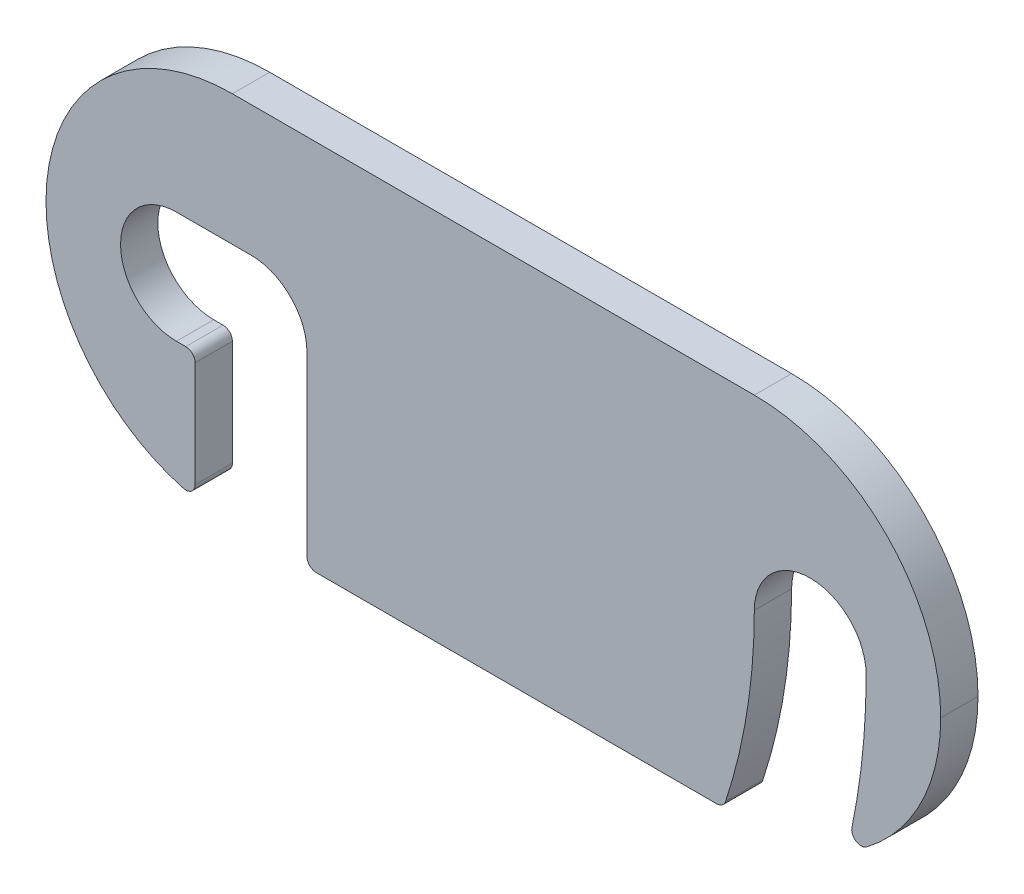
ISO-10303-21;
HEADER;
FILE_DESCRIPTION(('STEP AP214'),'2;1');
FILE_NAME('part.step','',(''),(''),'','','');
FILE_SCHEMA(('AUTOMOTIVE_DESIGN { 1 0 10303 214 1 1 1 1 }'));
ENDSEC;
DATA;
#1=APPLICATION_CONTEXT('core data for automotive mechanical design processes');
#2=APPLICATION_PROTOCOL_DEFINITION('international standard','automotive_design',2000,#1);
#3=PRODUCT_CONTEXT('',#1,'mechanical');
#4=PRODUCT('Part','Part','',(#3));
#5=PRODUCT_RELATED_PRODUCT_CATEGORY('part','',(#4));
#6=PRODUCT_DEFINITION_FORMATION('','',#4);
#7=PRODUCT_DEFINITION_CONTEXT('part definition',#1,'design');
#8=PRODUCT_DEFINITION('design','',#6,#7);
#9=PRODUCT_DEFINITION_SHAPE('','',#8);
#10=(LENGTH_UNIT() NAMED_UNIT(*) SI_UNIT(.MILLI.,.METRE.));
#11=(NAMED_UNIT(*) PLANE_ANGLE_UNIT() SI_UNIT($,.RADIAN.));
#12=(NAMED_UNIT(*) SI_UNIT($,.STERADIAN.) SOLID_ANGLE_UNIT());
#13=UNCERTAINTY_MEASURE_WITH_UNIT(LENGTH_MEASURE(1.E-05),#10,'distance_accuracy_value','');
#14=(GEOMETRIC_REPRESENTATION_CONTEXT(3) GLOBAL_UNCERTAINTY_ASSIGNED_CONTEXT((#13)) GLOBAL_UNIT_ASSIGNED_CONTEXT((#10,
#11,#12)) REPRESENTATION_CONTEXT('',''));
#15=CARTESIAN_POINT('',(0.,0.,0.));
#16=DIRECTION('',(0.,0.,1.));
#17=DIRECTION('',(1.,0.,0.));
#18=AXIS2_PLACEMENT_3D('',#15,#16,#17);
#19=CARTESIAN_POINT('',(0.,0.,2.));
#20=DIRECTION('',(0.,-1.,0.));
#21=DIRECTION('',(1.,0.,0.));
#22=AXIS2_PLACEMENT_3D('',#19,#20,#21);
#23=PLANE('',#22);
#24=DIRECTION('',(-1.,0.,0.));
#25=VECTOR('',#24,1.);
#26=CARTESIAN_POINT('',(0.,0.,2.));
#27=LINE('',#26,#25);
#28=CARTESIAN_POINT('',(-10.,0.,2.));
#29=VERTEX_POINT('',#28);
#30=CARTESIAN_POINT('',(-38.,0.,2.));
#31=VERTEX_POINT('',#30);
#32=EDGE_CURVE('E313',#29,#31,#27,.T.);
#33=ORIENTED_EDGE('',*,*,#32,.F.);
#34=DIRECTION('',(0.,0.,-1.));
#35=VECTOR('',#34,1.);
#36=CARTESIAN_POINT('',(-10.,0.,0.));
#37=LINE('',#36,#35);
#38=CARTESIAN_POINT('',(-10.,0.,0.));
#39=VERTEX_POINT('',#38);
#40=EDGE_CURVE('E223',#29,#39,#37,.T.);
#41=ORIENTED_EDGE('',*,*,#40,.T.);
#42=DIRECTION('',(-1.,0.,0.));
#43=VECTOR('',#42,1.);
#44=CARTESIAN_POINT('',(0.,0.,0.));
#45=LINE('',#44,#43);
#46=CARTESIAN_POINT('',(-38.,0.,0.));
#47=VERTEX_POINT('',#46);
#48=EDGE_CURVE('E208',#39,#47,#45,.T.);
#49=ORIENTED_EDGE('',*,*,#48,.T.);
#50=DIRECTION('',(0.,0.,-1.));
#51=VECTOR('',#50,1.);
#52=CARTESIAN_POINT('',(-38.,0.,2.));
#53=LINE('',#52,#51);
#54=EDGE_CURVE('E221',#47,#31,#53,.F.);
#55=ORIENTED_EDGE('',*,*,#54,.T.);
#56=EDGE_LOOP('',(#33,#41,#49,#55));
#57=FACE_BOUND('',#56,.T.);
#58=ADVANCED_FACE('F38',(#57),#23,.F.);
#59=CARTESIAN_POINT('',(0.,-20.,2.));
#60=DIRECTION('',(0.,-1.,0.));
#61=DIRECTION('',(1.,0.,0.));
#62=AXIS2_PLACEMENT_3D('',#59,#60,#61);
#63=PLANE('',#62);
#64=DIRECTION('',(-1.,0.,0.));
#65=VECTOR('',#64,1.);
#66=CARTESIAN_POINT('',(0.,-20.,0.));
#67=LINE('',#66,#65);
#68=CARTESIAN_POINT('',(-12.0172465076211,-20.,0.));
#69=VERTEX_POINT('',#68);
#70=CARTESIAN_POINT('',(-33.5,-20.,0.));
#71=VERTEX_POINT('',#70);
#72=EDGE_CURVE('E219',#69,#71,#67,.T.);
#73=ORIENTED_EDGE('',*,*,#72,.F.);
#74=DIRECTION('',(0.,0.,-1.));
#75=VECTOR('',#74,1.);
#76=CARTESIAN_POINT('',(-12.0172465076211,-20.,2.));
#77=LINE('',#76,#75);
#78=CARTESIAN_POINT('',(-12.0172465076211,-20.,2.));
#79=VERTEX_POINT('',#78);
#80=EDGE_CURVE('E290',#69,#79,#77,.F.);
#81=ORIENTED_EDGE('',*,*,#80,.T.);
#82=DIRECTION('',(-1.,0.,0.));
#83=VECTOR('',#82,1.);
#84=CARTESIAN_POINT('',(0.,-20.,2.));
#85=LINE('',#84,#83);
#86=CARTESIAN_POINT('',(-33.5,-20.,2.));
#87=VERTEX_POINT('',#86);
#88=EDGE_CURVE('E214',#79,#87,#85,.T.);
#89=ORIENTED_EDGE('',*,*,#88,.T.);
#90=DIRECTION('',(0.,0.,1.));
#91=VECTOR('',#90,1.);
#92=CARTESIAN_POINT('',(-33.5,-20.,0.));
#93=LINE('',#92,#91);
#94=EDGE_CURVE('E53',#87,#71,#93,.F.);
#95=ORIENTED_EDGE('',*,*,#94,.T.);
#96=EDGE_LOOP('',(#73,#81,#89,#95));
#97=FACE_BOUND('',#96,.T.);
#98=ADVANCED_FACE('F308',(#97),#63,.T.);
#99=CARTESIAN_POINT('',(-7.,-10.,2.));
#100=DIRECTION('',(0.,0.,-1.));
#101=DIRECTION('',(-1.,0.,0.));
#102=AXIS2_PLACEMENT_3D('',#99,#100,#101);
#103=CYLINDRICAL_SURFACE('',#102,3.);
#104=DIRECTION('',(0.,0.,1.));
#105=VECTOR('',#104,1.);
#106=CARTESIAN_POINT('',(-9.99999999999999,-10.,0.));
#107=LINE('',#106,#105);
#108=CARTESIAN_POINT('',(-9.99999999999999,-10.,0.));
#109=VERTEX_POINT('',#108);
#110=CARTESIAN_POINT('',(-9.99999999999999,-10.,2.));
#111=VERTEX_POINT('',#110);
#112=EDGE_CURVE('E325',#109,#111,#107,.T.);
#113=ORIENTED_EDGE('',*,*,#112,.F.);
#114=CARTESIAN_POINT('',(-7.,-10.,0.));
#115=DIRECTION('',(0.,0.,1.));
#116=DIRECTION('',(1.,0.,0.));
#117=AXIS2_PLACEMENT_3D('',#114,#115,#116);
#118=CIRCLE('',#117,3.);
#119=CARTESIAN_POINT('',(-4.,-10.,0.));
#120=VERTEX_POINT('',#119);
#121=EDGE_CURVE('E204',#120,#109,#118,.T.);
#122=ORIENTED_EDGE('',*,*,#121,.F.);
#123=DIRECTION('',(0.,0.,1.));
#124=VECTOR('',#123,1.);
#125=CARTESIAN_POINT('',(-4.,-10.,0.));
#126=LINE('',#125,#124);
#127=CARTESIAN_POINT('',(-4.,-10.,2.));
#128=VERTEX_POINT('',#127);
#129=EDGE_CURVE('E322',#120,#128,#126,.T.);
#130=ORIENTED_EDGE('',*,*,#129,.T.);
#131=CARTESIAN_POINT('',(-7.,-10.,2.));
#132=DIRECTION('',(0.,0.,1.));
#133=DIRECTION('',(1.,0.,0.));
#134=AXIS2_PLACEMENT_3D('',#131,#132,#133);
#135=CIRCLE('',#134,3.);
#136=EDGE_CURVE('E315',#128,#111,#135,.T.);
#137=ORIENTED_EDGE('',*,*,#136,.T.);
#138=EDGE_LOOP('',(#113,#122,#130,#137));
#139=FACE_BOUND('',#138,.T.);
#140=ADVANCED_FACE('F386',(#139),#103,.F.);
#141=CARTESIAN_POINT('',(-41.,-10.,2.));
#142=DIRECTION('',(0.,0.,-1.));
#143=DIRECTION('',(-1.,0.,0.));
#144=AXIS2_PLACEMENT_3D('',#141,#142,#143);
#145=CYLINDRICAL_SURFACE('',#144,3.00000000000001);
#146=DIRECTION('',(0.,0.,1.));
#147=VECTOR('',#146,1.);
#148=CARTESIAN_POINT('',(-41.,-7.,0.));
#149=LINE('',#148,#147);
#150=CARTESIAN_POINT('',(-41.,-7.,0.));
#151=VERTEX_POINT('',#150);
#152=CARTESIAN_POINT('',(-41.,-7.,2.));
#153=VERTEX_POINT('',#152);
#154=EDGE_CURVE('E197',#151,#153,#149,.T.);
#155=ORIENTED_EDGE('',*,*,#154,.T.);
#156=CARTESIAN_POINT('',(-41.,-10.,2.));
#157=DIRECTION('',(0.,0.,1.));
#158=DIRECTION('',(1.,0.,0.));
#159=AXIS2_PLACEMENT_3D('',#156,#157,#158);
#160=CIRCLE('',#159,3.00000000000001);
#161=CARTESIAN_POINT('',(-41.,-13.,2.));
#162=VERTEX_POINT('',#161);
#163=EDGE_CURVE('E196',#153,#162,#160,.T.);
#164=ORIENTED_EDGE('',*,*,#163,.T.);
#165=DIRECTION('',(0.,0.,1.));
#166=VECTOR('',#165,1.);
#167=CARTESIAN_POINT('',(-41.,-13.,0.));
#168=LINE('',#167,#166);
#169=CARTESIAN_POINT('',(-41.,-13.,0.));
#170=VERTEX_POINT('',#169);
#171=EDGE_CURVE('E180',#170,#162,#168,.T.);
#172=ORIENTED_EDGE('',*,*,#171,.F.);
#173=CARTESIAN_POINT('',(-41.,-10.,0.));
#174=DIRECTION('',(0.,0.,1.));
#175=DIRECTION('',(1.,0.,0.));
#176=AXIS2_PLACEMENT_3D('',#173,#174,#175);
#177=CIRCLE('',#176,3.00000000000001);
#178=EDGE_CURVE('E194',#151,#170,#177,.T.);
#179=ORIENTED_EDGE('',*,*,#178,.F.);
#180=EDGE_LOOP('',(#155,#164,#172,#179));
#181=FACE_BOUND('',#180,.T.);
#182=ADVANCED_FACE('F193',(#181),#145,.F.);
#183=CARTESIAN_POINT('',(0.,0.,2.));
#184=DIRECTION('',(0.,0.,1.));
#185=DIRECTION('',(1.,0.,0.));
#186=AXIS2_PLACEMENT_3D('',#183,#184,#185);
#187=PLANE('',#186);
#188=CARTESIAN_POINT('',(-41.,-10.,2.));
#189=DIRECTION('',(0.,0.,1.));
#190=DIRECTION('',(1.,0.,0.));
#191=AXIS2_PLACEMENT_3D('',#188,#189,#190);
#192=CIRCLE('',#191,37.);
#193=CARTESIAN_POINT('',(-4.76387096774193,-17.4795021731091,2.));
#194=VERTEX_POINT('',#193);
#195=EDGE_CURVE('E303',#194,#128,#192,.T.);
#196=ORIENTED_EDGE('',*,*,#195,.F.);
#197=CARTESIAN_POINT('',(-4.27419354838709,-17.5805765267998,2.));
#198=DIRECTION('',(0.,0.,1.));
#199=DIRECTION('',(1.,0.,0.));
#200=AXIS2_PLACEMENT_3D('',#197,#198,#199);
#201=CIRCLE('',#200,0.5);
#202=CARTESIAN_POINT('',(-3.97283531409168,-17.9795542387366,2.));
#203=VERTEX_POINT('',#202);
#204=EDGE_CURVE('E267',#194,#203,#201,.T.);
#205=ORIENTED_EDGE('',*,*,#204,.T.);
#206=CARTESIAN_POINT('',(-10.,-10.,2.));
#207=DIRECTION('',(0.,0.,1.));
#208=DIRECTION('',(1.,0.,0.));
#209=AXIS2_PLACEMENT_3D('',#206,#207,#208);
#210=CIRCLE('',#209,10.);
#211=CARTESIAN_POINT('',(0.,-10.,2.));
#212=VERTEX_POINT('',#211);
#213=EDGE_CURVE('E239',#203,#212,#210,.T.);
#214=ORIENTED_EDGE('',*,*,#213,.T.);
#215=CARTESIAN_POINT('',(-10.,-10.,2.));
#216=DIRECTION('',(0.,0.,1.));
#217=DIRECTION('',(1.,0.,0.));
#218=AXIS2_PLACEMENT_3D('',#215,#216,#217);
#219=CIRCLE('',#218,10.);
#220=EDGE_CURVE('E241',#212,#29,#219,.T.);
#221=ORIENTED_EDGE('',*,*,#220,.T.);
#222=ORIENTED_EDGE('',*,*,#32,.T.);
#223=CARTESIAN_POINT('',(-38.,-10.,2.));
#224=DIRECTION('',(0.,0.,1.));
#225=DIRECTION('',(1.,0.,0.));
#226=AXIS2_PLACEMENT_3D('',#223,#224,#225);
#227=CIRCLE('',#226,10.);
#228=CARTESIAN_POINT('',(-48.,-10.,2.));
#229=VERTEX_POINT('',#228);
#230=EDGE_CURVE('E234',#31,#229,#227,.T.);
#231=ORIENTED_EDGE('',*,*,#230,.T.);
#232=CARTESIAN_POINT('',(-38.,-10.,2.));
#233=DIRECTION('',(0.,0.,1.));
#234=DIRECTION('',(1.,0.,0.));
#235=AXIS2_PLACEMENT_3D('',#232,#233,#234);
#236=CIRCLE('',#235,10.);
#237=CARTESIAN_POINT('',(-40.6315789473684,-19.6475277788544,2.));
#238=VERTEX_POINT('',#237);
#239=EDGE_CURVE('E236',#229,#238,#236,.T.);
#240=ORIENTED_EDGE('',*,*,#239,.T.);
#241=CARTESIAN_POINT('',(-40.5,-19.1651513899117,2.));
#242=DIRECTION('',(0.,0.,1.));
#243=DIRECTION('',(1.,0.,0.));
#244=AXIS2_PLACEMENT_3D('',#241,#242,#243);
#245=CIRCLE('',#244,0.5);
#246=CARTESIAN_POINT('',(-40.,-19.1651513899117,2.));
#247=VERTEX_POINT('',#246);
#248=EDGE_CURVE('E263',#238,#247,#245,.T.);
#249=ORIENTED_EDGE('',*,*,#248,.T.);
#250=DIRECTION('',(0.,-1.,0.));
#251=VECTOR('',#250,1.);
#252=CARTESIAN_POINT('',(-40.,-13.,2.));
#253=LINE('',#252,#251);
#254=CARTESIAN_POINT('',(-40.,-13.5,2.));
#255=VERTEX_POINT('',#254);
#256=EDGE_CURVE('E335',#255,#247,#253,.T.);
#257=ORIENTED_EDGE('',*,*,#256,.F.);
#258=CARTESIAN_POINT('',(-40.5,-13.5,2.));
#259=DIRECTION('',(0.,0.,1.));
#260=DIRECTION('',(1.,0.,0.));
#261=AXIS2_PLACEMENT_3D('',#258,#259,#260);
#262=CIRCLE('',#261,0.5);
#263=CARTESIAN_POINT('',(-40.5,-13.,2.));
#264=VERTEX_POINT('',#263);
#265=EDGE_CURVE('E265',#255,#264,#262,.T.);
#266=ORIENTED_EDGE('',*,*,#265,.T.);
#267=DIRECTION('',(1.,0.,0.));
#268=VECTOR('',#267,1.);
#269=CARTESIAN_POINT('',(-41.,-13.,2.));
#270=LINE('',#269,#268);
#271=EDGE_CURVE('E327',#162,#264,#270,.T.);
#272=ORIENTED_EDGE('',*,*,#271,.F.);
#273=ORIENTED_EDGE('',*,*,#163,.F.);
#274=DIRECTION('',(-1.,0.,0.));
#275=VECTOR('',#274,1.);
#276=CARTESIAN_POINT('',(-34.,-7.,2.));
#277=LINE('',#276,#275);
#278=CARTESIAN_POINT('',(-37.,-7.,2.));
#279=VERTEX_POINT('',#278);
#280=EDGE_CURVE('E187',#279,#153,#277,.T.);
#281=ORIENTED_EDGE('',*,*,#280,.F.);
#282=CARTESIAN_POINT('',(-37.,-10.,2.));
#283=DIRECTION('',(0.,0.,1.));
#284=DIRECTION('',(1.,0.,0.));
#285=AXIS2_PLACEMENT_3D('',#282,#283,#284);
#286=CIRCLE('',#285,3.);
#287=CARTESIAN_POINT('',(-34.,-10.,2.));
#288=VERTEX_POINT('',#287);
#289=EDGE_CURVE('E251',#279,#288,#286,.F.);
#290=ORIENTED_EDGE('',*,*,#289,.T.);
#291=DIRECTION('',(0.,1.,0.));
#292=VECTOR('',#291,1.);
#293=CARTESIAN_POINT('',(-34.,-17.5,2.));
#294=LINE('',#293,#292);
#295=CARTESIAN_POINT('',(-34.,-19.5,2.));
#296=VERTEX_POINT('',#295);
#297=EDGE_CURVE('E333',#296,#288,#294,.T.);
#298=ORIENTED_EDGE('',*,*,#297,.F.);
#299=CARTESIAN_POINT('',(-33.5,-19.5,2.));
#300=DIRECTION('',(0.,0.,1.));
#301=DIRECTION('',(1.,0.,0.));
#302=AXIS2_PLACEMENT_3D('',#299,#300,#301);
#303=CIRCLE('',#302,0.5);
#304=EDGE_CURVE('E259',#296,#87,#303,.T.);
#305=ORIENTED_EDGE('',*,*,#304,.T.);
#306=ORIENTED_EDGE('',*,*,#88,.F.);
#307=CARTESIAN_POINT('',(-12.0172465076211,-19.5,2.));
#308=DIRECTION('',(0.,0.,1.));
#309=DIRECTION('',(1.,0.,0.));
#310=AXIS2_PLACEMENT_3D('',#307,#308,#309);
#311=CIRCLE('',#310,0.5);
#312=CARTESIAN_POINT('',(-11.5421194011887,-19.655737704918,2.));
#313=VERTEX_POINT('',#312);
#314=EDGE_CURVE('E261',#79,#313,#311,.T.);
#315=ORIENTED_EDGE('',*,*,#314,.T.);
#316=CARTESIAN_POINT('',(-41.,-10.,2.));
#317=DIRECTION('',(0.,0.,-1.));
#318=DIRECTION('',(1.,0.,0.));
#319=AXIS2_PLACEMENT_3D('',#316,#317,#318);
#320=CIRCLE('',#319,31.);
#321=EDGE_CURVE('E299',#111,#313,#320,.T.);
#322=ORIENTED_EDGE('',*,*,#321,.F.);
#323=ORIENTED_EDGE('',*,*,#136,.F.);
#324=EDGE_LOOP('',(#196,#205,#214,#221,#222,#231,#240,#249,#257,#266,#272,#273,#281,#290,#298,
#305,#306,#315,#322,#323));
#325=FACE_BOUND('',#324,.T.);
#326=ADVANCED_FACE('F311',(#325),#187,.T.);
#327=CARTESIAN_POINT('',(0.,0.,0.));
#328=DIRECTION('',(0.,0.,1.));
#329=DIRECTION('',(1.,0.,0.));
#330=AXIS2_PLACEMENT_3D('',#327,#328,#329);
#331=PLANE('',#330);
#332=CARTESIAN_POINT('',(-10.,-10.,0.));
#333=DIRECTION('',(0.,0.,1.));
#334=DIRECTION('',(1.,0.,0.));
#335=AXIS2_PLACEMENT_3D('',#332,#333,#334);
#336=CIRCLE('',#335,10.);
#337=CARTESIAN_POINT('',(0.,-10.,0.));
#338=VERTEX_POINT('',#337);
#339=CARTESIAN_POINT('',(-3.97283531409168,-17.9795542387366,0.));
#340=VERTEX_POINT('',#339);
#341=EDGE_CURVE('E230',#338,#340,#336,.F.);
#342=ORIENTED_EDGE('',*,*,#341,.T.);
#343=CARTESIAN_POINT('',(-4.27419354838709,-17.5805765267998,0.));
#344=DIRECTION('',(0.,0.,1.));
#345=DIRECTION('',(1.,0.,0.));
#346=AXIS2_PLACEMENT_3D('',#343,#344,#345);
#347=CIRCLE('',#346,0.5);
#348=CARTESIAN_POINT('',(-4.76387096774193,-17.4795021731091,0.));
#349=VERTEX_POINT('',#348);
#350=EDGE_CURVE('E278',#340,#349,#347,.F.);
#351=ORIENTED_EDGE('',*,*,#350,.T.);
#352=CARTESIAN_POINT('',(-41.,-10.,0.));
#353=DIRECTION('',(0.,0.,1.));
#354=DIRECTION('',(1.,0.,0.));
#355=AXIS2_PLACEMENT_3D('',#352,#353,#354);
#356=CIRCLE('',#355,37.);
#357=EDGE_CURVE('E302',#349,#120,#356,.T.);
#358=ORIENTED_EDGE('',*,*,#357,.T.);
#359=ORIENTED_EDGE('',*,*,#121,.T.);
#360=CARTESIAN_POINT('',(-41.,-10.,0.));
#361=DIRECTION('',(0.,0.,-1.));
#362=DIRECTION('',(1.,0.,0.));
#363=AXIS2_PLACEMENT_3D('',#360,#361,#362);
#364=CIRCLE('',#363,31.);
#365=CARTESIAN_POINT('',(-11.5421194011887,-19.655737704918,0.));
#366=VERTEX_POINT('',#365);
#367=EDGE_CURVE('E296',#109,#366,#364,.T.);
#368=ORIENTED_EDGE('',*,*,#367,.T.);
#369=CARTESIAN_POINT('',(-12.0172465076211,-19.5,0.));
#370=DIRECTION('',(0.,0.,1.));
#371=DIRECTION('',(1.,0.,0.));
#372=AXIS2_PLACEMENT_3D('',#369,#370,#371);
#373=CIRCLE('',#372,0.5);
#374=EDGE_CURVE('E60',#366,#69,#373,.F.);
#375=ORIENTED_EDGE('',*,*,#374,.T.);
#376=ORIENTED_EDGE('',*,*,#72,.T.);
#377=CARTESIAN_POINT('',(-33.5,-19.5,0.));
#378=DIRECTION('',(0.,0.,1.));
#379=DIRECTION('',(1.,0.,0.));
#380=AXIS2_PLACEMENT_3D('',#377,#378,#379);
#381=CIRCLE('',#380,0.5);
#382=CARTESIAN_POINT('',(-34.,-19.5,0.));
#383=VERTEX_POINT('',#382);
#384=EDGE_CURVE('E271',#71,#383,#381,.F.);
#385=ORIENTED_EDGE('',*,*,#384,.T.);
#386=DIRECTION('',(0.,1.,0.));
#387=VECTOR('',#386,1.);
#388=CARTESIAN_POINT('',(-34.,-17.5,0.));
#389=LINE('',#388,#387);
#390=CARTESIAN_POINT('',(-34.,-10.,0.));
#391=VERTEX_POINT('',#390);
#392=EDGE_CURVE('E340',#383,#391,#389,.T.);
#393=ORIENTED_EDGE('',*,*,#392,.T.);
#394=CARTESIAN_POINT('',(-37.,-10.,0.));
#395=DIRECTION('',(0.,0.,1.));
#396=DIRECTION('',(1.,0.,0.));
#397=AXIS2_PLACEMENT_3D('',#394,#395,#396);
#398=CIRCLE('',#397,3.);
#399=CARTESIAN_POINT('',(-37.,-7.,0.));
#400=VERTEX_POINT('',#399);
#401=EDGE_CURVE('E254',#391,#400,#398,.T.);
#402=ORIENTED_EDGE('',*,*,#401,.T.);
#403=DIRECTION('',(-1.,0.,0.));
#404=VECTOR('',#403,1.);
#405=CARTESIAN_POINT('',(-34.,-7.,0.));
#406=LINE('',#405,#404);
#407=EDGE_CURVE('E198',#400,#151,#406,.T.);
#408=ORIENTED_EDGE('',*,*,#407,.T.);
#409=ORIENTED_EDGE('',*,*,#178,.T.);
#410=DIRECTION('',(1.,0.,0.));
#411=VECTOR('',#410,1.);
#412=CARTESIAN_POINT('',(-41.,-13.,0.));
#413=LINE('',#412,#411);
#414=CARTESIAN_POINT('',(-40.5,-13.,0.));
#415=VERTEX_POINT('',#414);
#416=EDGE_CURVE('E176',#170,#415,#413,.T.);
#417=ORIENTED_EDGE('',*,*,#416,.T.);
#418=CARTESIAN_POINT('',(-40.5,-13.5,0.));
#419=DIRECTION('',(0.,0.,1.));
#420=DIRECTION('',(1.,0.,0.));
#421=AXIS2_PLACEMENT_3D('',#418,#419,#420);
#422=CIRCLE('',#421,0.5);
#423=CARTESIAN_POINT('',(-40.,-13.5,0.));
#424=VERTEX_POINT('',#423);
#425=EDGE_CURVE('E276',#415,#424,#422,.F.);
#426=ORIENTED_EDGE('',*,*,#425,.T.);
#427=DIRECTION('',(0.,-1.,0.));
#428=VECTOR('',#427,1.);
#429=CARTESIAN_POINT('',(-40.,-13.,0.));
#430=LINE('',#429,#428);
#431=CARTESIAN_POINT('',(-40.,-19.1651513899117,0.));
#432=VERTEX_POINT('',#431);
#433=EDGE_CURVE('E186',#424,#432,#430,.T.);
#434=ORIENTED_EDGE('',*,*,#433,.T.);
#435=CARTESIAN_POINT('',(-40.5,-19.1651513899117,0.));
#436=DIRECTION('',(0.,0.,1.));
#437=DIRECTION('',(1.,0.,0.));
#438=AXIS2_PLACEMENT_3D('',#435,#436,#437);
#439=CIRCLE('',#438,0.5);
#440=CARTESIAN_POINT('',(-40.6315789473684,-19.6475277788544,0.));
#441=VERTEX_POINT('',#440);
#442=EDGE_CURVE('E274',#432,#441,#439,.F.);
#443=ORIENTED_EDGE('',*,*,#442,.T.);
#444=CARTESIAN_POINT('',(-38.,-10.,0.));
#445=DIRECTION('',(0.,0.,1.));
#446=DIRECTION('',(1.,0.,0.));
#447=AXIS2_PLACEMENT_3D('',#444,#445,#446);
#448=CIRCLE('',#447,10.);
#449=CARTESIAN_POINT('',(-48.,-10.,0.));
#450=VERTEX_POINT('',#449);
#451=EDGE_CURVE('E228',#441,#450,#448,.F.);
#452=ORIENTED_EDGE('',*,*,#451,.T.);
#453=CARTESIAN_POINT('',(-38.,-10.,0.));
#454=DIRECTION('',(0.,0.,1.));
#455=DIRECTION('',(1.,0.,0.));
#456=AXIS2_PLACEMENT_3D('',#453,#454,#455);
#457=CIRCLE('',#456,10.);
#458=EDGE_CURVE('E226',#450,#47,#457,.F.);
#459=ORIENTED_EDGE('',*,*,#458,.T.);
#460=ORIENTED_EDGE('',*,*,#48,.F.);
#461=CARTESIAN_POINT('',(-10.,-10.,0.));
#462=DIRECTION('',(0.,0.,1.));
#463=DIRECTION('',(1.,0.,0.));
#464=AXIS2_PLACEMENT_3D('',#461,#462,#463);
#465=CIRCLE('',#464,10.);
#466=EDGE_CURVE('E232',#39,#338,#465,.F.);
#467=ORIENTED_EDGE('',*,*,#466,.T.);
#468=EDGE_LOOP('',(#342,#351,#358,#359,#368,#375,#376,#385,#393,#402,#408,#409,#417,#426,#434,
#443,#452,#459,#460,#467));
#469=FACE_BOUND('',#468,.T.);
#470=ADVANCED_FACE('F201',(#469),#331,.F.);
#471=CARTESIAN_POINT('',(-10.,-10.,2.));
#472=DIRECTION('',(0.,0.,-1.));
#473=DIRECTION('',(-1.,0.,0.));
#474=AXIS2_PLACEMENT_3D('',#471,#472,#473);
#475=CYLINDRICAL_SURFACE('',#474,10.);
#476=ORIENTED_EDGE('',*,*,#213,.F.);
#477=DIRECTION('',(0.,0.,-1.));
#478=VECTOR('',#477,1.);
#479=CARTESIAN_POINT('',(-3.97283531409168,-17.9795542387366,2.));
#480=LINE('',#479,#478);
#481=EDGE_CURVE('E269',#203,#340,#480,.T.);
#482=ORIENTED_EDGE('',*,*,#481,.T.);
#483=ORIENTED_EDGE('',*,*,#341,.F.);
#484=DIRECTION('',(0.,0.,-1.));
#485=VECTOR('',#484,1.);
#486=CARTESIAN_POINT('',(0.,-10.,2.));
#487=LINE('',#486,#485);
#488=EDGE_CURVE('E205',#212,#338,#487,.T.);
#489=ORIENTED_EDGE('',*,*,#488,.F.);
#490=EDGE_LOOP('',(#476,#482,#483,#489));
#491=FACE_BOUND('',#490,.T.);
#492=ADVANCED_FACE('F375',(#491),#475,.T.);
#493=CARTESIAN_POINT('',(-10.,-10.,2.));
#494=DIRECTION('',(0.,0.,1.));
#495=DIRECTION('',(1.,0.,0.));
#496=AXIS2_PLACEMENT_3D('',#493,#494,#495);
#497=CYLINDRICAL_SURFACE('',#496,10.);
#498=ORIENTED_EDGE('',*,*,#220,.F.);
#499=ORIENTED_EDGE('',*,*,#488,.T.);
#500=ORIENTED_EDGE('',*,*,#466,.F.);
#501=ORIENTED_EDGE('',*,*,#40,.F.);
#502=EDGE_LOOP('',(#498,#499,#500,#501));
#503=FACE_BOUND('',#502,.T.);
#504=ADVANCED_FACE('F369',(#503),#497,.T.);
#505=CARTESIAN_POINT('',(-38.,-10.,2.));
#506=DIRECTION('',(0.,0.,-1.));
#507=DIRECTION('',(-1.,0.,0.));
#508=AXIS2_PLACEMENT_3D('',#505,#506,#507);
#509=CYLINDRICAL_SURFACE('',#508,10.);
#510=DIRECTION('',(0.,0.,-1.));
#511=VECTOR('',#510,1.);
#512=CARTESIAN_POINT('',(-48.,-10.,2.));
#513=LINE('',#512,#511);
#514=EDGE_CURVE('E211',#229,#450,#513,.T.);
#515=ORIENTED_EDGE('',*,*,#514,.F.);
#516=ORIENTED_EDGE('',*,*,#230,.F.);
#517=ORIENTED_EDGE('',*,*,#54,.F.);
#518=ORIENTED_EDGE('',*,*,#458,.F.);
#519=EDGE_LOOP('',(#515,#516,#517,#518));
#520=FACE_BOUND('',#519,.T.);
#521=ADVANCED_FACE('F363',(#520),#509,.T.);
#522=CARTESIAN_POINT('',(-38.,-10.,2.));
#523=DIRECTION('',(0.,0.,1.));
#524=DIRECTION('',(1.,0.,0.));
#525=AXIS2_PLACEMENT_3D('',#522,#523,#524);
#526=CYLINDRICAL_SURFACE('',#525,10.);
#527=ORIENTED_EDGE('',*,*,#451,.F.);
#528=DIRECTION('',(0.,0.,1.));
#529=VECTOR('',#528,1.);
#530=CARTESIAN_POINT('',(-40.6315789473684,-19.6475277788544,2.));
#531=LINE('',#530,#529);
#532=EDGE_CURVE('E287',#441,#238,#531,.T.);
#533=ORIENTED_EDGE('',*,*,#532,.T.);
#534=ORIENTED_EDGE('',*,*,#239,.F.);
#535=ORIENTED_EDGE('',*,*,#514,.T.);
#536=EDGE_LOOP('',(#527,#533,#534,#535));
#537=FACE_BOUND('',#536,.T.);
#538=ADVANCED_FACE('F358',(#537),#526,.T.);
#539=CARTESIAN_POINT('',(-40.,-13.,0.));
#540=DIRECTION('',(-1.,0.,0.));
#541=DIRECTION('',(0.,0.,1.));
#542=AXIS2_PLACEMENT_3D('',#539,#540,#541);
#543=PLANE('',#542);
#544=ORIENTED_EDGE('',*,*,#433,.F.);
#545=DIRECTION('',(0.,0.,1.));
#546=VECTOR('',#545,1.);
#547=CARTESIAN_POINT('',(-40.,-13.5,0.));
#548=LINE('',#547,#546);
#549=EDGE_CURVE('E283',#424,#255,#548,.T.);
#550=ORIENTED_EDGE('',*,*,#549,.T.);
#551=ORIENTED_EDGE('',*,*,#256,.T.);
#552=DIRECTION('',(0.,0.,-1.));
#553=VECTOR('',#552,1.);
#554=CARTESIAN_POINT('',(-40.,-19.1651513899117,0.));
#555=LINE('',#554,#553);
#556=EDGE_CURVE('E280',#247,#432,#555,.T.);
#557=ORIENTED_EDGE('',*,*,#556,.T.);
#558=EDGE_LOOP('',(#544,#550,#551,#557));
#559=FACE_BOUND('',#558,.T.);
#560=ADVANCED_FACE('F347',(#559),#543,.F.);
#561=CARTESIAN_POINT('',(-41.,-13.,0.));
#562=DIRECTION('',(0.,-1.,0.));
#563=DIRECTION('',(1.,0.,0.));
#564=AXIS2_PLACEMENT_3D('',#561,#562,#563);
#565=PLANE('',#564);
#566=ORIENTED_EDGE('',*,*,#271,.T.);
#567=DIRECTION('',(0.,0.,1.));
#568=VECTOR('',#567,1.);
#569=CARTESIAN_POINT('',(-40.5,-13.,0.));
#570=LINE('',#569,#568);
#571=EDGE_CURVE('E183',#264,#415,#570,.F.);
#572=ORIENTED_EDGE('',*,*,#571,.T.);
#573=ORIENTED_EDGE('',*,*,#416,.F.);
#574=ORIENTED_EDGE('',*,*,#171,.T.);
#575=EDGE_LOOP('',(#566,#572,#573,#574));
#576=FACE_BOUND('',#575,.T.);
#577=ADVANCED_FACE('F179',(#576),#565,.F.);
#578=CARTESIAN_POINT('',(-41.,-10.,0.));
#579=DIRECTION('',(0.,0.,1.));
#580=DIRECTION('',(1.,0.,0.));
#581=AXIS2_PLACEMENT_3D('',#578,#579,#580);
#582=CYLINDRICAL_SURFACE('',#581,37.);
#583=ORIENTED_EDGE('',*,*,#357,.F.);
#584=DIRECTION('',(0.,0.,1.));
#585=VECTOR('',#584,1.);
#586=CARTESIAN_POINT('',(-4.76387096774193,-17.4795021731091,0.));
#587=LINE('',#586,#585);
#588=EDGE_CURVE('E256',#349,#194,#587,.T.);
#589=ORIENTED_EDGE('',*,*,#588,.T.);
#590=ORIENTED_EDGE('',*,*,#195,.T.);
#591=ORIENTED_EDGE('',*,*,#129,.F.);
#592=EDGE_LOOP('',(#583,#589,#590,#591));
#593=FACE_BOUND('',#592,.T.);
#594=ADVANCED_FACE('F383',(#593),#582,.F.);
#595=CARTESIAN_POINT('',(-41.,-10.,0.));
#596=DIRECTION('',(0.,0.,1.));
#597=DIRECTION('',(1.,0.,0.));
#598=AXIS2_PLACEMENT_3D('',#595,#596,#597);
#599=CYLINDRICAL_SURFACE('',#598,31.);
#600=ORIENTED_EDGE('',*,*,#321,.T.);
#601=DIRECTION('',(0.,0.,1.));
#602=VECTOR('',#601,1.);
#603=CARTESIAN_POINT('',(-11.5421194011887,-19.655737704918,0.));
#604=LINE('',#603,#602);
#605=EDGE_CURVE('E46',#313,#366,#604,.F.);
#606=ORIENTED_EDGE('',*,*,#605,.T.);
#607=ORIENTED_EDGE('',*,*,#367,.F.);
#608=ORIENTED_EDGE('',*,*,#112,.T.);
#609=EDGE_LOOP('',(#600,#606,#607,#608));
#610=FACE_BOUND('',#609,.T.);
#611=ADVANCED_FACE('F295',(#610),#599,.T.);
#612=CARTESIAN_POINT('',(-34.,-7.,0.));
#613=DIRECTION('',(0.,1.,0.));
#614=DIRECTION('',(0.,0.,1.));
#615=AXIS2_PLACEMENT_3D('',#612,#613,#614);
#616=PLANE('',#615);
#617=ORIENTED_EDGE('',*,*,#407,.F.);
#618=DIRECTION('',(0.,0.,1.));
#619=VECTOR('',#618,1.);
#620=CARTESIAN_POINT('',(-37.,-7.,2.));
#621=LINE('',#620,#619);
#622=EDGE_CURVE('E242',#400,#279,#621,.T.);
#623=ORIENTED_EDGE('',*,*,#622,.T.);
#624=ORIENTED_EDGE('',*,*,#280,.T.);
#625=ORIENTED_EDGE('',*,*,#154,.F.);
#626=EDGE_LOOP('',(#617,#623,#624,#625));
#627=FACE_BOUND('',#626,.T.);
#628=ADVANCED_FACE('F406',(#627),#616,.F.);
#629=CARTESIAN_POINT('',(-34.,-17.5,0.));
#630=DIRECTION('',(1.,0.,0.));
#631=DIRECTION('',(0.,0.,-1.));
#632=AXIS2_PLACEMENT_3D('',#629,#630,#631);
#633=PLANE('',#632);
#634=ORIENTED_EDGE('',*,*,#392,.F.);
#635=DIRECTION('',(0.,0.,1.));
#636=VECTOR('',#635,1.);
#637=CARTESIAN_POINT('',(-34.,-19.5,2.));
#638=LINE('',#637,#636);
#639=EDGE_CURVE('E11',#383,#296,#638,.T.);
#640=ORIENTED_EDGE('',*,*,#639,.T.);
#641=ORIENTED_EDGE('',*,*,#297,.T.);
#642=DIRECTION('',(0.,0.,1.));
#643=VECTOR('',#642,1.);
#644=CARTESIAN_POINT('',(-34.,-10.,0.));
#645=LINE('',#644,#643);
#646=EDGE_CURVE('E248',#288,#391,#645,.F.);
#647=ORIENTED_EDGE('',*,*,#646,.T.);
#648=EDGE_LOOP('',(#634,#640,#641,#647));
#649=FACE_BOUND('',#648,.T.);
#650=ADVANCED_FACE('F413',(#649),#633,.F.);
#651=CARTESIAN_POINT('',(-37.,-10.,0.));
#652=DIRECTION('',(0.,0.,-1.));
#653=DIRECTION('',(-1.,0.,0.));
#654=AXIS2_PLACEMENT_3D('',#651,#652,#653);
#655=CYLINDRICAL_SURFACE('',#654,3.);
#656=ORIENTED_EDGE('',*,*,#401,.F.);
#657=ORIENTED_EDGE('',*,*,#646,.F.);
#658=ORIENTED_EDGE('',*,*,#289,.F.);
#659=ORIENTED_EDGE('',*,*,#622,.F.);
#660=EDGE_LOOP('',(#656,#657,#658,#659));
#661=FACE_BOUND('',#660,.T.);
#662=ADVANCED_FACE('F416',(#661),#655,.F.);
#663=CARTESIAN_POINT('',(-4.27419354838709,-17.5805765267998,2.));
#664=DIRECTION('',(0.,0.,-1.));
#665=DIRECTION('',(-1.,0.,0.));
#666=AXIS2_PLACEMENT_3D('',#663,#664,#665);
#667=CYLINDRICAL_SURFACE('',#666,0.5);
#668=ORIENTED_EDGE('',*,*,#350,.F.);
#669=ORIENTED_EDGE('',*,*,#481,.F.);
#670=ORIENTED_EDGE('',*,*,#204,.F.);
#671=ORIENTED_EDGE('',*,*,#588,.F.);
#672=EDGE_LOOP('',(#668,#669,#670,#671));
#673=FACE_BOUND('',#672,.T.);
#674=ADVANCED_FACE('F378',(#673),#667,.T.);
#675=CARTESIAN_POINT('',(-40.5,-13.5,0.));
#676=DIRECTION('',(0.,0.,1.));
#677=DIRECTION('',(1.,0.,0.));
#678=AXIS2_PLACEMENT_3D('',#675,#676,#677);
#679=CYLINDRICAL_SURFACE('',#678,0.5);
#680=ORIENTED_EDGE('',*,*,#425,.F.);
#681=ORIENTED_EDGE('',*,*,#571,.F.);
#682=ORIENTED_EDGE('',*,*,#265,.F.);
#683=ORIENTED_EDGE('',*,*,#549,.F.);
#684=EDGE_LOOP('',(#680,#681,#682,#683));
#685=FACE_BOUND('',#684,.T.);
#686=ADVANCED_FACE('F351',(#685),#679,.T.);
#687=CARTESIAN_POINT('',(-40.5,-19.1651513899117,2.));
#688=DIRECTION('',(0.,0.,1.));
#689=DIRECTION('',(1.,0.,0.));
#690=AXIS2_PLACEMENT_3D('',#687,#688,#689);
#691=CYLINDRICAL_SURFACE('',#690,0.5);
#692=ORIENTED_EDGE('',*,*,#248,.F.);
#693=ORIENTED_EDGE('',*,*,#532,.F.);
#694=ORIENTED_EDGE('',*,*,#442,.F.);
#695=ORIENTED_EDGE('',*,*,#556,.F.);
#696=EDGE_LOOP('',(#692,#693,#694,#695));
#697=FACE_BOUND('',#696,.T.);
#698=ADVANCED_FACE('F354',(#697),#691,.T.);
#699=CARTESIAN_POINT('',(-12.0172465076211,-19.5,0.));
#700=DIRECTION('',(0.,0.,1.));
#701=DIRECTION('',(1.,0.,0.));
#702=AXIS2_PLACEMENT_3D('',#699,#700,#701);
#703=CYLINDRICAL_SURFACE('',#702,0.5);
#704=ORIENTED_EDGE('',*,*,#374,.F.);
#705=ORIENTED_EDGE('',*,*,#605,.F.);
#706=ORIENTED_EDGE('',*,*,#314,.F.);
#707=ORIENTED_EDGE('',*,*,#80,.F.);
#708=EDGE_LOOP('',(#704,#705,#706,#707));
#709=FACE_BOUND('',#708,.T.);
#710=ADVANCED_FACE('F306',(#709),#703,.T.);
#711=CARTESIAN_POINT('',(-33.5,-19.5,0.));
#712=DIRECTION('',(0.,0.,-1.));
#713=DIRECTION('',(-1.,0.,0.));
#714=AXIS2_PLACEMENT_3D('',#711,#712,#713);
#715=CYLINDRICAL_SURFACE('',#714,0.5);
#716=ORIENTED_EDGE('',*,*,#384,.F.);
#717=ORIENTED_EDGE('',*,*,#94,.F.);
#718=ORIENTED_EDGE('',*,*,#304,.F.);
#719=ORIENTED_EDGE('',*,*,#639,.F.);
#720=EDGE_LOOP('',(#716,#717,#718,#719));
#721=FACE_BOUND('',#720,.T.);
#722=ADVANCED_FACE('F40',(#721),#715,.T.);
#723=CLOSED_SHELL('',(#58,#98,#140,#182,#326,#470,#492,#504,#521,#538,#560,#577,#594,#611,#628,
#650,#662,#674,#686,#698,#710,#722));
#724=MANIFOLD_SOLID_BREP('B2',#723);
#725=ADVANCED_BREP_SHAPE_REPRESENTATION('',(#18,#724),#14);
#726=SHAPE_DEFINITION_REPRESENTATION(#9,#725);
ENDSEC;
END-ISO-10303-21;
